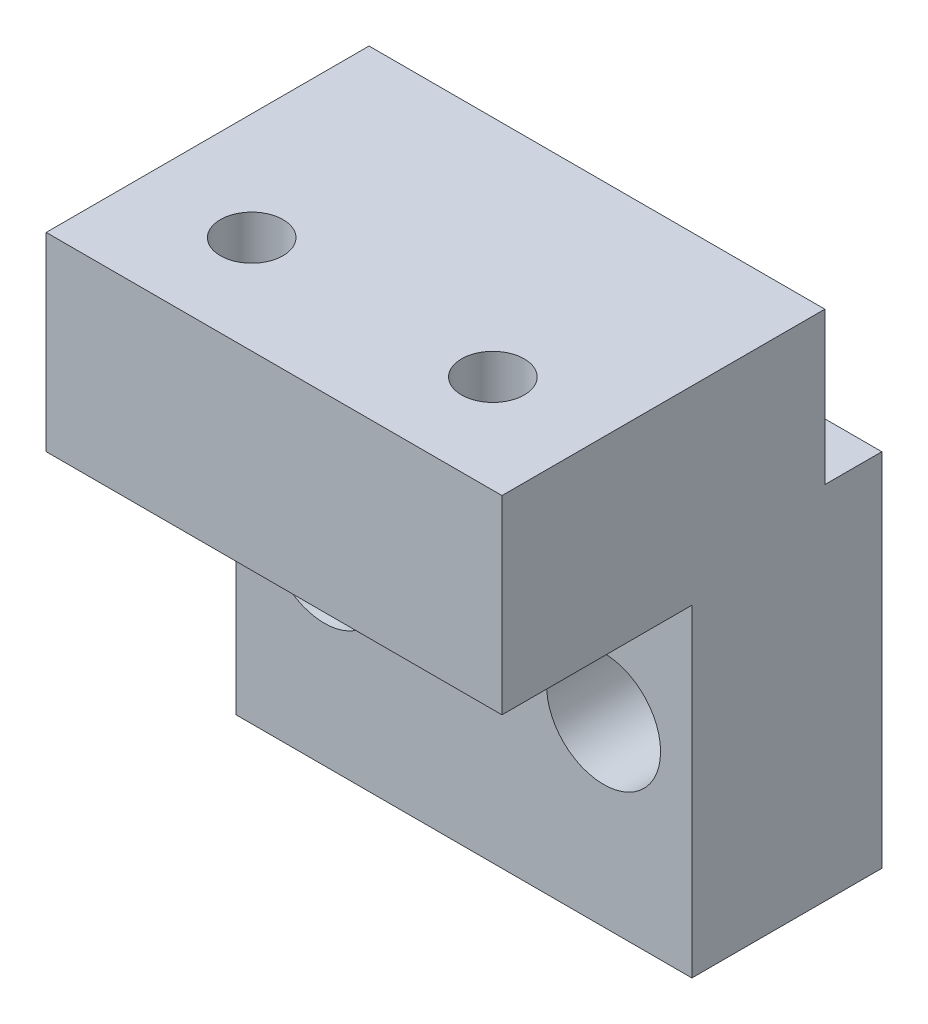
ISO-10303-21;
HEADER;
FILE_DESCRIPTION(('STEP AP214'),'2;1');
FILE_NAME('part.step','',(''),(''),'','','');
FILE_SCHEMA(('AUTOMOTIVE_DESIGN { 1 0 10303 214 1 1 1 1 }'));
ENDSEC;
DATA;
#1=APPLICATION_CONTEXT('core data for automotive mechanical design processes');
#2=APPLICATION_PROTOCOL_DEFINITION('international standard','automotive_design',2000,#1);
#3=PRODUCT_CONTEXT('',#1,'mechanical');
#4=PRODUCT('Part','Part','',(#3));
#5=PRODUCT_RELATED_PRODUCT_CATEGORY('part','',(#4));
#6=PRODUCT_DEFINITION_FORMATION('','',#4);
#7=PRODUCT_DEFINITION_CONTEXT('part definition',#1,'design');
#8=PRODUCT_DEFINITION('design','',#6,#7);
#9=PRODUCT_DEFINITION_SHAPE('','',#8);
#10=(LENGTH_UNIT() NAMED_UNIT(*) SI_UNIT(.MILLI.,.METRE.));
#11=(NAMED_UNIT(*) PLANE_ANGLE_UNIT() SI_UNIT($,.RADIAN.));
#12=(NAMED_UNIT(*) SI_UNIT($,.STERADIAN.) SOLID_ANGLE_UNIT());
#13=UNCERTAINTY_MEASURE_WITH_UNIT(LENGTH_MEASURE(1.E-05),#10,'distance_accuracy_value','');
#14=(GEOMETRIC_REPRESENTATION_CONTEXT(3) GLOBAL_UNCERTAINTY_ASSIGNED_CONTEXT((#13)) GLOBAL_UNIT_ASSIGNED_CONTEXT((#10,
#11,#12)) REPRESENTATION_CONTEXT('',''));
#15=CARTESIAN_POINT('',(0.,0.,0.));
#16=DIRECTION('',(0.,0.,1.));
#17=DIRECTION('',(1.,0.,0.));
#18=AXIS2_PLACEMENT_3D('',#15,#16,#17);
#19=CARTESIAN_POINT('',(-18.35,27.999975,14.8295040212929));
#20=DIRECTION('',(0.,1.,0.));
#21=DIRECTION('',(0.,0.,1.));
#22=AXIS2_PLACEMENT_3D('',#19,#20,#21);
#23=CYLINDRICAL_SURFACE('',#22,1.65);
#24=CARTESIAN_POINT('',(-18.35,55.,14.8295040212929));
#25=DIRECTION('',(0.,1.,0.));
#26=DIRECTION('',(0.,0.,1.));
#27=AXIS2_PLACEMENT_3D('',#24,#25,#26);
#28=CIRCLE('',#27,1.65);
#29=CARTESIAN_POINT('',(-18.35,55.,16.4795040212929));
#30=VERTEX_POINT('',#29);
#31=EDGE_CURVE('E273',#30,#30,#28,.T.);
#32=ORIENTED_EDGE('',*,*,#31,.T.);
#33=EDGE_LOOP('',(#32));
#34=FACE_BOUND('',#33,.T.);
#35=CARTESIAN_POINT('',(-18.35,47.2,14.8295040212929));
#36=DIRECTION('',(0.,-1.,0.));
#37=DIRECTION('',(0.,0.,-1.));
#38=AXIS2_PLACEMENT_3D('',#35,#36,#37);
#39=CIRCLE('',#38,1.65);
#40=CARTESIAN_POINT('',(-18.35,47.2,13.1795040212929));
#41=VERTEX_POINT('',#40);
#42=EDGE_CURVE('E36',#41,#41,#39,.F.);
#43=ORIENTED_EDGE('',*,*,#42,.F.);
#44=EDGE_LOOP('',(#43));
#45=FACE_BOUND('',#44,.T.);
#46=ADVANCED_FACE('F32',(#34,#45),#23,.F.);
#47=CARTESIAN_POINT('',(-5.65,27.999975,14.8295040212929));
#48=DIRECTION('',(0.,1.,0.));
#49=DIRECTION('',(0.,0.,1.));
#50=AXIS2_PLACEMENT_3D('',#47,#48,#49);
#51=CYLINDRICAL_SURFACE('',#50,1.65);
#52=CARTESIAN_POINT('',(-5.65,55.,14.8295040212929));
#53=DIRECTION('',(0.,1.,0.));
#54=DIRECTION('',(0.,0.,1.));
#55=AXIS2_PLACEMENT_3D('',#52,#53,#54);
#56=CIRCLE('',#55,1.65);
#57=CARTESIAN_POINT('',(-5.65,55.,16.4795040212929));
#58=VERTEX_POINT('',#57);
#59=EDGE_CURVE('E276',#58,#58,#56,.T.);
#60=ORIENTED_EDGE('',*,*,#59,.T.);
#61=EDGE_LOOP('',(#60));
#62=FACE_BOUND('',#61,.T.);
#63=CARTESIAN_POINT('',(-5.65,47.2,14.8295040212929));
#64=DIRECTION('',(0.,-1.,0.));
#65=DIRECTION('',(0.,0.,-1.));
#66=AXIS2_PLACEMENT_3D('',#63,#64,#65);
#67=CIRCLE('',#66,1.65);
#68=CARTESIAN_POINT('',(-5.65,47.2,13.1795040212929));
#69=VERTEX_POINT('',#68);
#70=EDGE_CURVE('E263',#69,#69,#67,.F.);
#71=ORIENTED_EDGE('',*,*,#70,.F.);
#72=EDGE_LOOP('',(#71));
#73=FACE_BOUND('',#72,.T.);
#74=ADVANCED_FACE('F316',(#62,#73),#51,.F.);
#75=CARTESIAN_POINT('',(-24.,47.,10.));
#76=DIRECTION('',(0.,-1.,0.));
#77=DIRECTION('',(0.,0.,-1.));
#78=AXIS2_PLACEMENT_3D('',#75,#76,#77);
#79=PLANE('',#78);
#80=DIRECTION('',(-1.,0.,0.));
#81=VECTOR('',#80,1.);
#82=CARTESIAN_POINT('',(0.,47.,3.));
#83=LINE('',#82,#81);
#84=CARTESIAN_POINT('',(0.,47.,3.));
#85=VERTEX_POINT('',#84);
#86=CARTESIAN_POINT('',(-24.,47.,3.));
#87=VERTEX_POINT('',#86);
#88=EDGE_CURVE('E309',#85,#87,#83,.T.);
#89=ORIENTED_EDGE('',*,*,#88,.F.);
#90=DIRECTION('',(0.,0.,-1.));
#91=VECTOR('',#90,1.);
#92=CARTESIAN_POINT('',(0.,47.,10.));
#93=LINE('',#92,#91);
#94=CARTESIAN_POINT('',(0.,47.,0.));
#95=VERTEX_POINT('',#94);
#96=EDGE_CURVE('E405',#85,#95,#93,.T.);
#97=ORIENTED_EDGE('',*,*,#96,.T.);
#98=DIRECTION('',(-1.,0.,0.));
#99=VECTOR('',#98,1.);
#100=CARTESIAN_POINT('',(-24.,47.,0.));
#101=LINE('',#100,#99);
#102=CARTESIAN_POINT('',(-24.,47.,0.));
#103=VERTEX_POINT('',#102);
#104=EDGE_CURVE('E409',#95,#103,#101,.T.);
#105=ORIENTED_EDGE('',*,*,#104,.T.);
#106=DIRECTION('',(0.,0.,-1.));
#107=VECTOR('',#106,1.);
#108=CARTESIAN_POINT('',(-24.,47.,10.));
#109=LINE('',#108,#107);
#110=EDGE_CURVE('E419',#87,#103,#109,.T.);
#111=ORIENTED_EDGE('',*,*,#110,.F.);
#112=EDGE_LOOP('',(#89,#97,#105,#111));
#113=FACE_BOUND('',#112,.T.);
#114=ADVANCED_FACE('F318',(#113),#79,.F.);
#115=CARTESIAN_POINT('',(-19.35,37.5,10.));
#116=DIRECTION('',(0.,0.,-1.));
#117=DIRECTION('',(-1.,0.,0.));
#118=AXIS2_PLACEMENT_3D('',#115,#116,#117);
#119=CYLINDRICAL_SURFACE('',#118,1.65);
#120=CARTESIAN_POINT('',(-19.35,37.5,0.));
#121=DIRECTION('',(0.,0.,1.));
#122=DIRECTION('',(1.,0.,0.));
#123=AXIS2_PLACEMENT_3D('',#120,#121,#122);
#124=CIRCLE('',#123,1.65);
#125=CARTESIAN_POINT('',(-17.7,37.5,0.));
#126=VERTEX_POINT('',#125);
#127=EDGE_CURVE('E451',#126,#126,#124,.T.);
#128=ORIENTED_EDGE('',*,*,#127,.F.);
#129=EDGE_LOOP('',(#128));
#130=FACE_BOUND('',#129,.T.);
#131=CARTESIAN_POINT('',(-19.35,37.5,4.5));
#132=DIRECTION('',(0.,0.,1.));
#133=DIRECTION('',(1.,0.,0.));
#134=AXIS2_PLACEMENT_3D('',#131,#132,#133);
#135=CIRCLE('',#134,1.65);
#136=CARTESIAN_POINT('',(-17.7,37.5,4.5));
#137=VERTEX_POINT('',#136);
#138=EDGE_CURVE('E422',#137,#137,#135,.T.);
#139=ORIENTED_EDGE('',*,*,#138,.T.);
#140=EDGE_LOOP('',(#139));
#141=FACE_BOUND('',#140,.T.);
#142=ADVANCED_FACE('F325',(#130,#141),#119,.F.);
#143=CARTESIAN_POINT('',(-4.65,37.5,10.));
#144=DIRECTION('',(0.,0.,-1.));
#145=DIRECTION('',(-1.,0.,0.));
#146=AXIS2_PLACEMENT_3D('',#143,#144,#145);
#147=CYLINDRICAL_SURFACE('',#146,1.65);
#148=CARTESIAN_POINT('',(-4.65,37.5,0.));
#149=DIRECTION('',(0.,0.,1.));
#150=DIRECTION('',(1.,0.,0.));
#151=AXIS2_PLACEMENT_3D('',#148,#149,#150);
#152=CIRCLE('',#151,1.65);
#153=CARTESIAN_POINT('',(-3.,37.5,0.));
#154=VERTEX_POINT('',#153);
#155=EDGE_CURVE('E448',#154,#154,#152,.T.);
#156=ORIENTED_EDGE('',*,*,#155,.F.);
#157=EDGE_LOOP('',(#156));
#158=FACE_BOUND('',#157,.T.);
#159=CARTESIAN_POINT('',(-4.65,37.5,4.5));
#160=DIRECTION('',(0.,0.,1.));
#161=DIRECTION('',(1.,0.,0.));
#162=AXIS2_PLACEMENT_3D('',#159,#160,#161);
#163=CIRCLE('',#162,1.65);
#164=CARTESIAN_POINT('',(-3.,37.5,4.5));
#165=VERTEX_POINT('',#164);
#166=EDGE_CURVE('E444',#165,#165,#163,.T.);
#167=ORIENTED_EDGE('',*,*,#166,.T.);
#168=EDGE_LOOP('',(#167));
#169=FACE_BOUND('',#168,.T.);
#170=ADVANCED_FACE('F365',(#158,#169),#147,.F.);
#171=CARTESIAN_POINT('',(0.,0.,10.));
#172=DIRECTION('',(0.,0.,1.));
#173=DIRECTION('',(1.,0.,0.));
#174=AXIS2_PLACEMENT_3D('',#171,#172,#173);
#175=PLANE('',#174);
#176=DIRECTION('',(1.,0.,0.));
#177=VECTOR('',#176,1.);
#178=CARTESIAN_POINT('',(0.,45.,10.));
#179=LINE('',#178,#177);
#180=CARTESIAN_POINT('',(-24.,45.,10.));
#181=VERTEX_POINT('',#180);
#182=CARTESIAN_POINT('',(0.,45.,10.));
#183=VERTEX_POINT('',#182);
#184=EDGE_CURVE('E279',#181,#183,#179,.T.);
#185=ORIENTED_EDGE('',*,*,#184,.F.);
#186=DIRECTION('',(0.,-1.,0.));
#187=VECTOR('',#186,1.);
#188=CARTESIAN_POINT('',(-24.,47.,10.));
#189=LINE('',#188,#187);
#190=CARTESIAN_POINT('',(-24.,28.,10.));
#191=VERTEX_POINT('',#190);
#192=EDGE_CURVE('E411',#181,#191,#189,.T.);
#193=ORIENTED_EDGE('',*,*,#192,.T.);
#194=DIRECTION('',(1.,0.,0.));
#195=VECTOR('',#194,1.);
#196=CARTESIAN_POINT('',(-24.,28.,10.));
#197=LINE('',#196,#195);
#198=CARTESIAN_POINT('',(0.,28.,10.));
#199=VERTEX_POINT('',#198);
#200=EDGE_CURVE('E456',#191,#199,#197,.T.);
#201=ORIENTED_EDGE('',*,*,#200,.T.);
#202=DIRECTION('',(0.,1.,0.));
#203=VECTOR('',#202,1.);
#204=CARTESIAN_POINT('',(0.,47.,10.));
#205=LINE('',#204,#203);
#206=EDGE_CURVE('E299',#199,#183,#205,.T.);
#207=ORIENTED_EDGE('',*,*,#206,.T.);
#208=EDGE_LOOP('',(#185,#193,#201,#207));
#209=FACE_BOUND('',#208,.T.);
#210=CARTESIAN_POINT('',(-19.35,37.5,10.));
#211=DIRECTION('',(0.,0.,1.));
#212=DIRECTION('',(1.,0.,0.));
#213=AXIS2_PLACEMENT_3D('',#210,#211,#212);
#214=CIRCLE('',#213,3.);
#215=CARTESIAN_POINT('',(-16.35,37.5,10.));
#216=VERTEX_POINT('',#215);
#217=EDGE_CURVE('E437',#216,#216,#214,.T.);
#218=ORIENTED_EDGE('',*,*,#217,.F.);
#219=EDGE_LOOP('',(#218));
#220=FACE_BOUND('',#219,.T.);
#221=CARTESIAN_POINT('',(-4.65,37.5,10.));
#222=DIRECTION('',(0.,0.,1.));
#223=DIRECTION('',(1.,0.,0.));
#224=AXIS2_PLACEMENT_3D('',#221,#222,#223);
#225=CIRCLE('',#224,3.);
#226=CARTESIAN_POINT('',(-1.65,37.5,10.));
#227=VERTEX_POINT('',#226);
#228=EDGE_CURVE('E445',#227,#227,#225,.T.);
#229=ORIENTED_EDGE('',*,*,#228,.F.);
#230=EDGE_LOOP('',(#229));
#231=FACE_BOUND('',#230,.T.);
#232=ADVANCED_FACE('F368',(#209,#220,#231),#175,.T.);
#233=CARTESIAN_POINT('',(0.,0.,0.));
#234=DIRECTION('',(0.,0.,1.));
#235=DIRECTION('',(1.,0.,0.));
#236=AXIS2_PLACEMENT_3D('',#233,#234,#235);
#237=PLANE('',#236);
#238=ORIENTED_EDGE('',*,*,#127,.T.);
#239=EDGE_LOOP('',(#238));
#240=FACE_BOUND('',#239,.T.);
#241=DIRECTION('',(0.,-1.,0.));
#242=VECTOR('',#241,1.);
#243=CARTESIAN_POINT('',(-24.,47.,0.));
#244=LINE('',#243,#242);
#245=CARTESIAN_POINT('',(-24.,28.,0.));
#246=VERTEX_POINT('',#245);
#247=EDGE_CURVE('E400',#103,#246,#244,.T.);
#248=ORIENTED_EDGE('',*,*,#247,.F.);
#249=ORIENTED_EDGE('',*,*,#104,.F.);
#250=DIRECTION('',(0.,1.,0.));
#251=VECTOR('',#250,1.);
#252=CARTESIAN_POINT('',(0.,47.,0.));
#253=LINE('',#252,#251);
#254=CARTESIAN_POINT('',(0.,28.,0.));
#255=VERTEX_POINT('',#254);
#256=EDGE_CURVE('E399',#255,#95,#253,.T.);
#257=ORIENTED_EDGE('',*,*,#256,.F.);
#258=DIRECTION('',(1.,0.,0.));
#259=VECTOR('',#258,1.);
#260=CARTESIAN_POINT('',(-24.,28.,0.));
#261=LINE('',#260,#259);
#262=EDGE_CURVE('E390',#246,#255,#261,.T.);
#263=ORIENTED_EDGE('',*,*,#262,.F.);
#264=EDGE_LOOP('',(#248,#249,#257,#263));
#265=FACE_BOUND('',#264,.T.);
#266=ORIENTED_EDGE('',*,*,#155,.T.);
#267=EDGE_LOOP('',(#266));
#268=FACE_BOUND('',#267,.T.);
#269=ADVANCED_FACE('F375',(#240,#265,#268),#237,.F.);
#270=CARTESIAN_POINT('',(-24.,47.,10.));
#271=DIRECTION('',(1.,0.,0.));
#272=DIRECTION('',(0.,0.,-1.));
#273=AXIS2_PLACEMENT_3D('',#270,#271,#272);
#274=PLANE('',#273);
#275=ORIENTED_EDGE('',*,*,#247,.T.);
#276=DIRECTION('',(0.,0.,-1.));
#277=VECTOR('',#276,1.);
#278=CARTESIAN_POINT('',(-24.,28.,10.));
#279=LINE('',#278,#277);
#280=EDGE_CURVE('E11',#191,#246,#279,.T.);
#281=ORIENTED_EDGE('',*,*,#280,.F.);
#282=ORIENTED_EDGE('',*,*,#192,.F.);
#283=DIRECTION('',(0.,0.,-1.));
#284=VECTOR('',#283,1.);
#285=CARTESIAN_POINT('',(-24.,45.,20.));
#286=LINE('',#285,#284);
#287=CARTESIAN_POINT('',(-24.,45.,20.));
#288=VERTEX_POINT('',#287);
#289=EDGE_CURVE('E304',#288,#181,#286,.T.);
#290=ORIENTED_EDGE('',*,*,#289,.F.);
#291=DIRECTION('',(0.,-1.,0.));
#292=VECTOR('',#291,1.);
#293=CARTESIAN_POINT('',(-24.,45.,20.));
#294=LINE('',#293,#292);
#295=CARTESIAN_POINT('',(-24.,55.,20.));
#296=VERTEX_POINT('',#295);
#297=EDGE_CURVE('E286',#296,#288,#294,.T.);
#298=ORIENTED_EDGE('',*,*,#297,.F.);
#299=DIRECTION('',(0.,0.,1.));
#300=VECTOR('',#299,1.);
#301=CARTESIAN_POINT('',(-24.,55.,10.));
#302=LINE('',#301,#300);
#303=CARTESIAN_POINT('',(-24.,55.,3.));
#304=VERTEX_POINT('',#303);
#305=EDGE_CURVE('E433',#304,#296,#302,.T.);
#306=ORIENTED_EDGE('',*,*,#305,.F.);
#307=DIRECTION('',(0.,-1.,0.));
#308=VECTOR('',#307,1.);
#309=CARTESIAN_POINT('',(-24.,55.,3.));
#310=LINE('',#309,#308);
#311=EDGE_CURVE('E428',#304,#87,#310,.T.);
#312=ORIENTED_EDGE('',*,*,#311,.T.);
#313=ORIENTED_EDGE('',*,*,#110,.T.);
#314=EDGE_LOOP('',(#275,#281,#282,#290,#298,#306,#312,#313));
#315=FACE_BOUND('',#314,.T.);
#316=ADVANCED_FACE('F34',(#315),#274,.F.);
#317=CARTESIAN_POINT('',(-24.,28.,10.));
#318=DIRECTION('',(0.,1.,0.));
#319=DIRECTION('',(0.,0.,1.));
#320=AXIS2_PLACEMENT_3D('',#317,#318,#319);
#321=PLANE('',#320);
#322=ORIENTED_EDGE('',*,*,#262,.T.);
#323=DIRECTION('',(0.,0.,-1.));
#324=VECTOR('',#323,1.);
#325=CARTESIAN_POINT('',(0.,28.,10.));
#326=LINE('',#325,#324);
#327=EDGE_CURVE('E41',#199,#255,#326,.T.);
#328=ORIENTED_EDGE('',*,*,#327,.F.);
#329=ORIENTED_EDGE('',*,*,#200,.F.);
#330=ORIENTED_EDGE('',*,*,#280,.T.);
#331=EDGE_LOOP('',(#322,#328,#329,#330));
#332=FACE_BOUND('',#331,.T.);
#333=ADVANCED_FACE('F381',(#332),#321,.F.);
#334=CARTESIAN_POINT('',(0.,47.,10.));
#335=DIRECTION('',(-1.,0.,0.));
#336=DIRECTION('',(0.,0.,1.));
#337=AXIS2_PLACEMENT_3D('',#334,#335,#336);
#338=PLANE('',#337);
#339=ORIENTED_EDGE('',*,*,#256,.T.);
#340=ORIENTED_EDGE('',*,*,#96,.F.);
#341=DIRECTION('',(0.,-1.,0.));
#342=VECTOR('',#341,1.);
#343=CARTESIAN_POINT('',(0.,55.,3.));
#344=LINE('',#343,#342);
#345=CARTESIAN_POINT('',(0.,55.,3.));
#346=VERTEX_POINT('',#345);
#347=EDGE_CURVE('E440',#346,#85,#344,.T.);
#348=ORIENTED_EDGE('',*,*,#347,.F.);
#349=DIRECTION('',(0.,0.,-1.));
#350=VECTOR('',#349,1.);
#351=CARTESIAN_POINT('',(0.,55.,10.));
#352=LINE('',#351,#350);
#353=CARTESIAN_POINT('',(0.,55.,20.));
#354=VERTEX_POINT('',#353);
#355=EDGE_CURVE('E293',#354,#346,#352,.T.);
#356=ORIENTED_EDGE('',*,*,#355,.F.);
#357=DIRECTION('',(0.,1.,0.));
#358=VECTOR('',#357,1.);
#359=CARTESIAN_POINT('',(0.,45.,20.));
#360=LINE('',#359,#358);
#361=CARTESIAN_POINT('',(0.,45.,20.));
#362=VERTEX_POINT('',#361);
#363=EDGE_CURVE('E280',#362,#354,#360,.T.);
#364=ORIENTED_EDGE('',*,*,#363,.F.);
#365=DIRECTION('',(0.,0.,-1.));
#366=VECTOR('',#365,1.);
#367=CARTESIAN_POINT('',(0.,45.,20.));
#368=LINE('',#367,#366);
#369=EDGE_CURVE('E290',#362,#183,#368,.T.);
#370=ORIENTED_EDGE('',*,*,#369,.T.);
#371=ORIENTED_EDGE('',*,*,#206,.F.);
#372=ORIENTED_EDGE('',*,*,#327,.T.);
#373=EDGE_LOOP('',(#339,#340,#348,#356,#364,#370,#371,#372));
#374=FACE_BOUND('',#373,.T.);
#375=ADVANCED_FACE('F363',(#374),#338,.F.);
#376=CARTESIAN_POINT('',(-4.65,37.5,4.5));
#377=DIRECTION('',(0.,0.,1.));
#378=DIRECTION('',(1.,0.,0.));
#379=AXIS2_PLACEMENT_3D('',#376,#377,#378);
#380=CYLINDRICAL_SURFACE('',#379,3.);
#381=CARTESIAN_POINT('',(-4.65,37.5,4.5));
#382=DIRECTION('',(0.,0.,1.));
#383=DIRECTION('',(1.,0.,0.));
#384=AXIS2_PLACEMENT_3D('',#381,#382,#383);
#385=CIRCLE('',#384,3.);
#386=CARTESIAN_POINT('',(-1.65,37.5,4.5));
#387=VERTEX_POINT('',#386);
#388=EDGE_CURVE('E441',#387,#387,#385,.T.);
#389=ORIENTED_EDGE('',*,*,#388,.F.);
#390=EDGE_LOOP('',(#389));
#391=FACE_BOUND('',#390,.T.);
#392=ORIENTED_EDGE('',*,*,#228,.T.);
#393=EDGE_LOOP('',(#392));
#394=FACE_BOUND('',#393,.T.);
#395=ADVANCED_FACE('F359',(#391,#394),#380,.F.);
#396=CARTESIAN_POINT('',(-4.65,37.5,4.5));
#397=DIRECTION('',(0.,0.,1.));
#398=DIRECTION('',(1.,0.,0.));
#399=AXIS2_PLACEMENT_3D('',#396,#397,#398);
#400=PLANE('',#399);
#401=ORIENTED_EDGE('',*,*,#166,.F.);
#402=EDGE_LOOP('',(#401));
#403=FACE_BOUND('',#402,.T.);
#404=ORIENTED_EDGE('',*,*,#388,.T.);
#405=EDGE_LOOP('',(#404));
#406=FACE_BOUND('',#405,.T.);
#407=ADVANCED_FACE('F355',(#403,#406),#400,.T.);
#408=CARTESIAN_POINT('',(-19.35,37.5,4.5));
#409=DIRECTION('',(0.,0.,1.));
#410=DIRECTION('',(1.,0.,0.));
#411=AXIS2_PLACEMENT_3D('',#408,#409,#410);
#412=CYLINDRICAL_SURFACE('',#411,3.);
#413=CARTESIAN_POINT('',(-19.35,37.5,4.5));
#414=DIRECTION('',(0.,0.,1.));
#415=DIRECTION('',(1.,0.,0.));
#416=AXIS2_PLACEMENT_3D('',#413,#414,#415);
#417=CIRCLE('',#416,3.);
#418=CARTESIAN_POINT('',(-16.35,37.5,4.5));
#419=VERTEX_POINT('',#418);
#420=EDGE_CURVE('E434',#419,#419,#417,.T.);
#421=ORIENTED_EDGE('',*,*,#420,.F.);
#422=EDGE_LOOP('',(#421));
#423=FACE_BOUND('',#422,.T.);
#424=ORIENTED_EDGE('',*,*,#217,.T.);
#425=EDGE_LOOP('',(#424));
#426=FACE_BOUND('',#425,.T.);
#427=ADVANCED_FACE('F351',(#423,#426),#412,.F.);
#428=CARTESIAN_POINT('',(-19.35,37.5,4.5));
#429=DIRECTION('',(0.,0.,1.));
#430=DIRECTION('',(1.,0.,0.));
#431=AXIS2_PLACEMENT_3D('',#428,#429,#430);
#432=PLANE('',#431);
#433=ORIENTED_EDGE('',*,*,#138,.F.);
#434=EDGE_LOOP('',(#433));
#435=FACE_BOUND('',#434,.T.);
#436=ORIENTED_EDGE('',*,*,#420,.T.);
#437=EDGE_LOOP('',(#436));
#438=FACE_BOUND('',#437,.T.);
#439=ADVANCED_FACE('F347',(#435,#438),#432,.T.);
#440=CARTESIAN_POINT('',(0.,55.,3.));
#441=DIRECTION('',(0.,0.,1.));
#442=DIRECTION('',(1.,0.,0.));
#443=AXIS2_PLACEMENT_3D('',#440,#441,#442);
#444=PLANE('',#443);
#445=ORIENTED_EDGE('',*,*,#88,.T.);
#446=ORIENTED_EDGE('',*,*,#311,.F.);
#447=DIRECTION('',(-1.,0.,0.));
#448=VECTOR('',#447,1.);
#449=CARTESIAN_POINT('',(0.,55.,3.));
#450=LINE('',#449,#448);
#451=EDGE_CURVE('E466',#346,#304,#450,.T.);
#452=ORIENTED_EDGE('',*,*,#451,.F.);
#453=ORIENTED_EDGE('',*,*,#347,.T.);
#454=EDGE_LOOP('',(#445,#446,#452,#453));
#455=FACE_BOUND('',#454,.T.);
#456=ADVANCED_FACE('F343',(#455),#444,.F.);
#457=CARTESIAN_POINT('',(0.,55.,0.));
#458=DIRECTION('',(0.,1.,0.));
#459=DIRECTION('',(0.,0.,1.));
#460=AXIS2_PLACEMENT_3D('',#457,#458,#459);
#461=PLANE('',#460);
#462=ORIENTED_EDGE('',*,*,#31,.F.);
#463=EDGE_LOOP('',(#462));
#464=FACE_BOUND('',#463,.T.);
#465=ORIENTED_EDGE('',*,*,#59,.F.);
#466=EDGE_LOOP('',(#465));
#467=FACE_BOUND('',#466,.T.);
#468=ORIENTED_EDGE('',*,*,#355,.T.);
#469=ORIENTED_EDGE('',*,*,#451,.T.);
#470=ORIENTED_EDGE('',*,*,#305,.T.);
#471=DIRECTION('',(-1.,0.,0.));
#472=VECTOR('',#471,1.);
#473=CARTESIAN_POINT('',(0.,55.,20.));
#474=LINE('',#473,#472);
#475=EDGE_CURVE('E283',#354,#296,#474,.T.);
#476=ORIENTED_EDGE('',*,*,#475,.F.);
#477=EDGE_LOOP('',(#468,#469,#470,#476));
#478=FACE_BOUND('',#477,.T.);
#479=ADVANCED_FACE('F339',(#464,#467,#478),#461,.T.);
#480=CARTESIAN_POINT('',(0.,45.,20.));
#481=DIRECTION('',(0.,1.,0.));
#482=DIRECTION('',(0.,0.,1.));
#483=AXIS2_PLACEMENT_3D('',#480,#481,#482);
#484=PLANE('',#483);
#485=DIRECTION('',(-0.500000000000001,0.,0.866025403784438));
#486=VECTOR('',#485,1.);
#487=CARTESIAN_POINT('',(-15.0591034656192,45.,14.8295040212929));
#488=LINE('',#487,#486);
#489=CARTESIAN_POINT('',(-15.0591034656192,45.,14.8295040212929));
#490=VERTEX_POINT('',#489);
#491=CARTESIAN_POINT('',(-16.7045517328096,45.,17.6795040212929));
#492=VERTEX_POINT('',#491);
#493=EDGE_CURVE('E207',#490,#492,#488,.T.);
#494=ORIENTED_EDGE('',*,*,#493,.F.);
#495=DIRECTION('',(0.5,0.,0.866025403784439));
#496=VECTOR('',#495,1.);
#497=CARTESIAN_POINT('',(-16.7045517328096,45.,11.9795040212929));
#498=LINE('',#497,#496);
#499=CARTESIAN_POINT('',(-16.7045517328096,45.,11.9795040212929));
#500=VERTEX_POINT('',#499);
#501=EDGE_CURVE('E49',#500,#490,#498,.T.);
#502=ORIENTED_EDGE('',*,*,#501,.F.);
#503=DIRECTION('',(1.,0.,0.));
#504=VECTOR('',#503,1.);
#505=CARTESIAN_POINT('',(-19.9954482671905,45.,11.9795040212929));
#506=LINE('',#505,#504);
#507=CARTESIAN_POINT('',(-19.9954482671905,45.,11.9795040212929));
#508=VERTEX_POINT('',#507);
#509=EDGE_CURVE('E193',#508,#500,#506,.T.);
#510=ORIENTED_EDGE('',*,*,#509,.F.);
#511=DIRECTION('',(0.5,0.,-0.866025403784438));
#512=VECTOR('',#511,1.);
#513=CARTESIAN_POINT('',(-21.6408965343809,45.,14.8295040212929));
#514=LINE('',#513,#512);
#515=CARTESIAN_POINT('',(-21.6408965343809,45.,14.8295040212929));
#516=VERTEX_POINT('',#515);
#517=EDGE_CURVE('E196',#516,#508,#514,.T.);
#518=ORIENTED_EDGE('',*,*,#517,.F.);
#519=DIRECTION('',(-0.5,0.,-0.866025403784438));
#520=VECTOR('',#519,1.);
#521=CARTESIAN_POINT('',(-19.9954482671905,45.,17.6795040212929));
#522=LINE('',#521,#520);
#523=CARTESIAN_POINT('',(-19.9954482671905,45.,17.6795040212929));
#524=VERTEX_POINT('',#523);
#525=EDGE_CURVE('E212',#524,#516,#522,.T.);
#526=ORIENTED_EDGE('',*,*,#525,.F.);
#527=DIRECTION('',(-1.,0.,0.));
#528=VECTOR('',#527,1.);
#529=CARTESIAN_POINT('',(-16.7045517328096,45.,17.6795040212929));
#530=LINE('',#529,#528);
#531=EDGE_CURVE('E209',#492,#524,#530,.T.);
#532=ORIENTED_EDGE('',*,*,#531,.F.);
#533=EDGE_LOOP('',(#494,#502,#510,#518,#526,#532));
#534=FACE_BOUND('',#533,.T.);
#535=DIRECTION('',(-0.5,0.,0.866025403784438));
#536=VECTOR('',#535,1.);
#537=CARTESIAN_POINT('',(-2.35910346561914,45.,14.8295040212929));
#538=LINE('',#537,#536);
#539=CARTESIAN_POINT('',(-2.35910346561914,45.,14.8295040212929));
#540=VERTEX_POINT('',#539);
#541=CARTESIAN_POINT('',(-4.00455173280957,45.,17.6795040212929));
#542=VERTEX_POINT('',#541);
#543=EDGE_CURVE('E247',#540,#542,#538,.T.);
#544=ORIENTED_EDGE('',*,*,#543,.F.);
#545=DIRECTION('',(0.499999999999999,0.,0.866025403784439));
#546=VECTOR('',#545,1.);
#547=CARTESIAN_POINT('',(-4.00455173280957,45.,11.9795040212929));
#548=LINE('',#547,#546);
#549=CARTESIAN_POINT('',(-4.00455173280957,45.,11.9795040212929));
#550=VERTEX_POINT('',#549);
#551=EDGE_CURVE('E57',#550,#540,#548,.T.);
#552=ORIENTED_EDGE('',*,*,#551,.F.);
#553=DIRECTION('',(1.,0.,0.));
#554=VECTOR('',#553,1.);
#555=CARTESIAN_POINT('',(-7.29544826719043,45.,11.9795040212929));
#556=LINE('',#555,#554);
#557=CARTESIAN_POINT('',(-7.29544826719043,45.,11.9795040212929));
#558=VERTEX_POINT('',#557);
#559=EDGE_CURVE('E230',#558,#550,#556,.T.);
#560=ORIENTED_EDGE('',*,*,#559,.F.);
#561=DIRECTION('',(0.5,0.,-0.866025403784438));
#562=VECTOR('',#561,1.);
#563=CARTESIAN_POINT('',(-8.94089653438086,45.,14.8295040212929));
#564=LINE('',#563,#562);
#565=CARTESIAN_POINT('',(-8.94089653438086,45.,14.8295040212929));
#566=VERTEX_POINT('',#565);
#567=EDGE_CURVE('E256',#566,#558,#564,.T.);
#568=ORIENTED_EDGE('',*,*,#567,.F.);
#569=DIRECTION('',(-0.5,0.,-0.866025403784439));
#570=VECTOR('',#569,1.);
#571=CARTESIAN_POINT('',(-7.29544826719043,45.,17.6795040212929));
#572=LINE('',#571,#570);
#573=CARTESIAN_POINT('',(-7.29544826719043,45.,17.6795040212929));
#574=VERTEX_POINT('',#573);
#575=EDGE_CURVE('E253',#574,#566,#572,.T.);
#576=ORIENTED_EDGE('',*,*,#575,.F.);
#577=DIRECTION('',(-1.,0.,0.));
#578=VECTOR('',#577,1.);
#579=CARTESIAN_POINT('',(-4.00455173280957,45.,17.6795040212929));
#580=LINE('',#579,#578);
#581=EDGE_CURVE('E250',#542,#574,#580,.T.);
#582=ORIENTED_EDGE('',*,*,#581,.F.);
#583=EDGE_LOOP('',(#544,#552,#560,#568,#576,#582));
#584=FACE_BOUND('',#583,.T.);
#585=ORIENTED_EDGE('',*,*,#184,.T.);
#586=ORIENTED_EDGE('',*,*,#369,.F.);
#587=DIRECTION('',(1.,0.,0.));
#588=VECTOR('',#587,1.);
#589=CARTESIAN_POINT('',(0.,45.,20.));
#590=LINE('',#589,#588);
#591=EDGE_CURVE('E288',#288,#362,#590,.T.);
#592=ORIENTED_EDGE('',*,*,#591,.F.);
#593=ORIENTED_EDGE('',*,*,#289,.T.);
#594=EDGE_LOOP('',(#585,#586,#592,#593));
#595=FACE_BOUND('',#594,.T.);
#596=ADVANCED_FACE('F335',(#534,#584,#595),#484,.F.);
#597=CARTESIAN_POINT('',(0.,0.,20.));
#598=DIRECTION('',(0.,0.,1.));
#599=DIRECTION('',(1.,0.,0.));
#600=AXIS2_PLACEMENT_3D('',#597,#598,#599);
#601=PLANE('',#600);
#602=ORIENTED_EDGE('',*,*,#363,.T.);
#603=ORIENTED_EDGE('',*,*,#475,.T.);
#604=ORIENTED_EDGE('',*,*,#297,.T.);
#605=ORIENTED_EDGE('',*,*,#591,.T.);
#606=EDGE_LOOP('',(#602,#603,#604,#605));
#607=FACE_BOUND('',#606,.T.);
#608=ADVANCED_FACE('F332',(#607),#601,.T.);
#609=CARTESIAN_POINT('',(0.,47.2,0.));
#610=DIRECTION('',(0.,-1.,0.));
#611=DIRECTION('',(0.,0.,-1.));
#612=AXIS2_PLACEMENT_3D('',#609,#610,#611);
#613=PLANE('',#612);
#614=DIRECTION('',(0.499999999999999,0.,0.866025403784439));
#615=VECTOR('',#614,1.);
#616=CARTESIAN_POINT('',(-4.00455173280957,47.2,11.9795040212929));
#617=LINE('',#616,#615);
#618=CARTESIAN_POINT('',(-4.00455173280957,47.2,11.9795040212929));
#619=VERTEX_POINT('',#618);
#620=CARTESIAN_POINT('',(-2.35910346561914,47.2,14.8295040212929));
#621=VERTEX_POINT('',#620);
#622=EDGE_CURVE('E226',#619,#621,#617,.T.);
#623=ORIENTED_EDGE('',*,*,#622,.T.);
#624=DIRECTION('',(-0.5,0.,0.866025403784438));
#625=VECTOR('',#624,1.);
#626=CARTESIAN_POINT('',(-2.35910346561914,47.2,14.8295040212929));
#627=LINE('',#626,#625);
#628=CARTESIAN_POINT('',(-4.00455173280957,47.2,17.6795040212929));
#629=VERTEX_POINT('',#628);
#630=EDGE_CURVE('E229',#621,#629,#627,.T.);
#631=ORIENTED_EDGE('',*,*,#630,.T.);
#632=DIRECTION('',(-1.,0.,0.));
#633=VECTOR('',#632,1.);
#634=CARTESIAN_POINT('',(-4.00455173280957,47.2,17.6795040212929));
#635=LINE('',#634,#633);
#636=CARTESIAN_POINT('',(-7.29544826719043,47.2,17.6795040212929));
#637=VERTEX_POINT('',#636);
#638=EDGE_CURVE('E233',#629,#637,#635,.T.);
#639=ORIENTED_EDGE('',*,*,#638,.T.);
#640=DIRECTION('',(-0.5,0.,-0.866025403784439));
#641=VECTOR('',#640,1.);
#642=CARTESIAN_POINT('',(-7.29544826719043,47.2,17.6795040212929));
#643=LINE('',#642,#641);
#644=CARTESIAN_POINT('',(-8.94089653438086,47.2,14.8295040212929));
#645=VERTEX_POINT('',#644);
#646=EDGE_CURVE('E236',#637,#645,#643,.T.);
#647=ORIENTED_EDGE('',*,*,#646,.T.);
#648=DIRECTION('',(0.5,0.,-0.866025403784438));
#649=VECTOR('',#648,1.);
#650=CARTESIAN_POINT('',(-8.94089653438086,47.2,14.8295040212929));
#651=LINE('',#650,#649);
#652=CARTESIAN_POINT('',(-7.29544826719043,47.2,11.9795040212929));
#653=VERTEX_POINT('',#652);
#654=EDGE_CURVE('E239',#645,#653,#651,.T.);
#655=ORIENTED_EDGE('',*,*,#654,.T.);
#656=DIRECTION('',(1.,0.,0.));
#657=VECTOR('',#656,1.);
#658=CARTESIAN_POINT('',(-7.29544826719043,47.2,11.9795040212929));
#659=LINE('',#658,#657);
#660=EDGE_CURVE('E242',#653,#619,#659,.T.);
#661=ORIENTED_EDGE('',*,*,#660,.T.);
#662=EDGE_LOOP('',(#623,#631,#639,#647,#655,#661));
#663=FACE_BOUND('',#662,.T.);
#664=ORIENTED_EDGE('',*,*,#70,.T.);
#665=EDGE_LOOP('',(#664));
#666=FACE_BOUND('',#665,.T.);
#667=ADVANCED_FACE('F314',(#663,#666),#613,.T.);
#668=CARTESIAN_POINT('',(-4.00455173280957,47.2,11.9795040212929));
#669=DIRECTION('',(0.866025403784439,0.,-0.499999999999999));
#670=DIRECTION('',(-0.499999999999999,0.,-0.866025403784439));
#671=AXIS2_PLACEMENT_3D('',#668,#669,#670);
#672=PLANE('',#671);
#673=ORIENTED_EDGE('',*,*,#551,.T.);
#674=DIRECTION('',(0.,-1.,0.));
#675=VECTOR('',#674,1.);
#676=CARTESIAN_POINT('',(-2.35910346561914,47.2,14.8295040212929));
#677=LINE('',#676,#675);
#678=EDGE_CURVE('E245',#621,#540,#677,.T.);
#679=ORIENTED_EDGE('',*,*,#678,.F.);
#680=ORIENTED_EDGE('',*,*,#622,.F.);
#681=DIRECTION('',(0.,-1.,0.));
#682=VECTOR('',#681,1.);
#683=CARTESIAN_POINT('',(-4.00455173280957,47.2,11.9795040212929));
#684=LINE('',#683,#682);
#685=EDGE_CURVE('E261',#619,#550,#684,.T.);
#686=ORIENTED_EDGE('',*,*,#685,.T.);
#687=EDGE_LOOP('',(#673,#679,#680,#686));
#688=FACE_BOUND('',#687,.T.);
#689=ADVANCED_FACE('F554',(#688),#672,.F.);
#690=CARTESIAN_POINT('',(-7.29544826719043,47.2,11.9795040212929));
#691=DIRECTION('',(0.,0.,-1.));
#692=DIRECTION('',(-1.,0.,0.));
#693=AXIS2_PLACEMENT_3D('',#690,#691,#692);
#694=PLANE('',#693);
#695=ORIENTED_EDGE('',*,*,#559,.T.);
#696=ORIENTED_EDGE('',*,*,#685,.F.);
#697=ORIENTED_EDGE('',*,*,#660,.F.);
#698=DIRECTION('',(0.,-1.,0.));
#699=VECTOR('',#698,1.);
#700=CARTESIAN_POINT('',(-7.29544826719043,47.2,11.9795040212929));
#701=LINE('',#700,#699);
#702=EDGE_CURVE('E264',#653,#558,#701,.T.);
#703=ORIENTED_EDGE('',*,*,#702,.T.);
#704=EDGE_LOOP('',(#695,#696,#697,#703));
#705=FACE_BOUND('',#704,.T.);
#706=ADVANCED_FACE('F562',(#705),#694,.F.);
#707=CARTESIAN_POINT('',(-8.94089653438086,47.2,14.8295040212929));
#708=DIRECTION('',(-0.866025403784438,0.,-0.5));
#709=DIRECTION('',(-0.5,0.,0.866025403784438));
#710=AXIS2_PLACEMENT_3D('',#707,#708,#709);
#711=PLANE('',#710);
#712=ORIENTED_EDGE('',*,*,#567,.T.);
#713=ORIENTED_EDGE('',*,*,#702,.F.);
#714=ORIENTED_EDGE('',*,*,#654,.F.);
#715=DIRECTION('',(0.,-1.,0.));
#716=VECTOR('',#715,1.);
#717=CARTESIAN_POINT('',(-8.94089653438086,47.2,14.8295040212929));
#718=LINE('',#717,#716);
#719=EDGE_CURVE('E266',#645,#566,#718,.T.);
#720=ORIENTED_EDGE('',*,*,#719,.T.);
#721=EDGE_LOOP('',(#712,#713,#714,#720));
#722=FACE_BOUND('',#721,.T.);
#723=ADVANCED_FACE('F568',(#722),#711,.F.);
#724=CARTESIAN_POINT('',(-7.29544826719043,47.2,17.6795040212929));
#725=DIRECTION('',(-0.866025403784439,0.,0.5));
#726=DIRECTION('',(0.5,0.,0.866025403784439));
#727=AXIS2_PLACEMENT_3D('',#724,#725,#726);
#728=PLANE('',#727);
#729=ORIENTED_EDGE('',*,*,#575,.T.);
#730=ORIENTED_EDGE('',*,*,#719,.F.);
#731=ORIENTED_EDGE('',*,*,#646,.F.);
#732=DIRECTION('',(0.,-1.,0.));
#733=VECTOR('',#732,1.);
#734=CARTESIAN_POINT('',(-7.29544826719043,47.2,17.6795040212929));
#735=LINE('',#734,#733);
#736=EDGE_CURVE('E268',#637,#574,#735,.T.);
#737=ORIENTED_EDGE('',*,*,#736,.T.);
#738=EDGE_LOOP('',(#729,#730,#731,#737));
#739=FACE_BOUND('',#738,.T.);
#740=ADVANCED_FACE('F576',(#739),#728,.F.);
#741=CARTESIAN_POINT('',(-4.00455173280957,47.2,17.6795040212929));
#742=DIRECTION('',(0.,0.,1.));
#743=DIRECTION('',(1.,0.,0.));
#744=AXIS2_PLACEMENT_3D('',#741,#742,#743);
#745=PLANE('',#744);
#746=ORIENTED_EDGE('',*,*,#581,.T.);
#747=ORIENTED_EDGE('',*,*,#736,.F.);
#748=ORIENTED_EDGE('',*,*,#638,.F.);
#749=DIRECTION('',(0.,-1.,0.));
#750=VECTOR('',#749,1.);
#751=CARTESIAN_POINT('',(-4.00455173280957,47.2,17.6795040212929));
#752=LINE('',#751,#750);
#753=EDGE_CURVE('E270',#629,#542,#752,.T.);
#754=ORIENTED_EDGE('',*,*,#753,.T.);
#755=EDGE_LOOP('',(#746,#747,#748,#754));
#756=FACE_BOUND('',#755,.T.);
#757=ADVANCED_FACE('F584',(#756),#745,.F.);
#758=CARTESIAN_POINT('',(-2.35910346561914,47.2,14.8295040212929));
#759=DIRECTION('',(0.866025403784438,0.,0.5));
#760=DIRECTION('',(0.5,0.,-0.866025403784438));
#761=AXIS2_PLACEMENT_3D('',#758,#759,#760);
#762=PLANE('',#761);
#763=ORIENTED_EDGE('',*,*,#543,.T.);
#764=ORIENTED_EDGE('',*,*,#753,.F.);
#765=ORIENTED_EDGE('',*,*,#630,.F.);
#766=ORIENTED_EDGE('',*,*,#678,.T.);
#767=EDGE_LOOP('',(#763,#764,#765,#766));
#768=FACE_BOUND('',#767,.T.);
#769=ADVANCED_FACE('F592',(#768),#762,.F.);
#770=CARTESIAN_POINT('',(0.,47.2,0.));
#771=DIRECTION('',(0.,-1.,0.));
#772=DIRECTION('',(0.,0.,-1.));
#773=AXIS2_PLACEMENT_3D('',#770,#771,#772);
#774=PLANE('',#773);
#775=DIRECTION('',(0.5,0.,0.866025403784439));
#776=VECTOR('',#775,1.);
#777=CARTESIAN_POINT('',(-16.7045517328096,47.2,11.9795040212929));
#778=LINE('',#777,#776);
#779=CARTESIAN_POINT('',(-16.7045517328096,47.2,11.9795040212929));
#780=VERTEX_POINT('',#779);
#781=CARTESIAN_POINT('',(-15.0591034656192,47.2,14.8295040212929));
#782=VERTEX_POINT('',#781);
#783=EDGE_CURVE('E173',#780,#782,#778,.T.);
#784=ORIENTED_EDGE('',*,*,#783,.T.);
#785=DIRECTION('',(-0.500000000000001,0.,0.866025403784438));
#786=VECTOR('',#785,1.);
#787=CARTESIAN_POINT('',(-15.0591034656192,47.2,14.8295040212929));
#788=LINE('',#787,#786);
#789=CARTESIAN_POINT('',(-16.7045517328096,47.2,17.6795040212929));
#790=VERTEX_POINT('',#789);
#791=EDGE_CURVE('E182',#782,#790,#788,.T.);
#792=ORIENTED_EDGE('',*,*,#791,.T.);
#793=DIRECTION('',(-1.,0.,0.));
#794=VECTOR('',#793,1.);
#795=CARTESIAN_POINT('',(-16.7045517328096,47.2,17.6795040212929));
#796=LINE('',#795,#794);
#797=CARTESIAN_POINT('',(-19.9954482671905,47.2,17.6795040212929));
#798=VERTEX_POINT('',#797);
#799=EDGE_CURVE('E187',#790,#798,#796,.T.);
#800=ORIENTED_EDGE('',*,*,#799,.T.);
#801=DIRECTION('',(-0.5,0.,-0.866025403784438));
#802=VECTOR('',#801,1.);
#803=CARTESIAN_POINT('',(-19.9954482671905,47.2,17.6795040212929));
#804=LINE('',#803,#802);
#805=CARTESIAN_POINT('',(-21.6408965343809,47.2,14.8295040212929));
#806=VERTEX_POINT('',#805);
#807=EDGE_CURVE('E200',#798,#806,#804,.T.);
#808=ORIENTED_EDGE('',*,*,#807,.T.);
#809=DIRECTION('',(0.5,0.,-0.866025403784438));
#810=VECTOR('',#809,1.);
#811=CARTESIAN_POINT('',(-21.6408965343809,47.2,14.8295040212929));
#812=LINE('',#811,#810);
#813=CARTESIAN_POINT('',(-19.9954482671905,47.2,11.9795040212929));
#814=VERTEX_POINT('',#813);
#815=EDGE_CURVE('E203',#806,#814,#812,.T.);
#816=ORIENTED_EDGE('',*,*,#815,.T.);
#817=DIRECTION('',(1.,0.,0.));
#818=VECTOR('',#817,1.);
#819=CARTESIAN_POINT('',(-19.9954482671905,47.2,11.9795040212929));
#820=LINE('',#819,#818);
#821=EDGE_CURVE('E179',#814,#780,#820,.T.);
#822=ORIENTED_EDGE('',*,*,#821,.T.);
#823=EDGE_LOOP('',(#784,#792,#800,#808,#816,#822));
#824=FACE_BOUND('',#823,.T.);
#825=ORIENTED_EDGE('',*,*,#42,.T.);
#826=EDGE_LOOP('',(#825));
#827=FACE_BOUND('',#826,.T.);
#828=ADVANCED_FACE('F189',(#824,#827),#774,.T.);
#829=CARTESIAN_POINT('',(-16.7045517328096,47.2,11.9795040212929));
#830=DIRECTION('',(0.866025403784439,0.,-0.5));
#831=DIRECTION('',(-0.5,0.,-0.866025403784439));
#832=AXIS2_PLACEMENT_3D('',#829,#830,#831);
#833=PLANE('',#832);
#834=ORIENTED_EDGE('',*,*,#501,.T.);
#835=DIRECTION('',(0.,-1.,0.));
#836=VECTOR('',#835,1.);
#837=CARTESIAN_POINT('',(-15.0591034656192,47.2,14.8295040212929));
#838=LINE('',#837,#836);
#839=EDGE_CURVE('E169',#782,#490,#838,.T.);
#840=ORIENTED_EDGE('',*,*,#839,.F.);
#841=ORIENTED_EDGE('',*,*,#783,.F.);
#842=DIRECTION('',(0.,-1.,0.));
#843=VECTOR('',#842,1.);
#844=CARTESIAN_POINT('',(-16.7045517328096,47.2,11.9795040212929));
#845=LINE('',#844,#843);
#846=EDGE_CURVE('E217',#780,#500,#845,.T.);
#847=ORIENTED_EDGE('',*,*,#846,.T.);
#848=EDGE_LOOP('',(#834,#840,#841,#847));
#849=FACE_BOUND('',#848,.T.);
#850=ADVANCED_FACE('F171',(#849),#833,.F.);
#851=CARTESIAN_POINT('',(-19.9954482671905,47.2,11.9795040212929));
#852=DIRECTION('',(0.,0.,-1.));
#853=DIRECTION('',(-1.,0.,0.));
#854=AXIS2_PLACEMENT_3D('',#851,#852,#853);
#855=PLANE('',#854);
#856=ORIENTED_EDGE('',*,*,#509,.T.);
#857=ORIENTED_EDGE('',*,*,#846,.F.);
#858=ORIENTED_EDGE('',*,*,#821,.F.);
#859=DIRECTION('',(0.,-1.,0.));
#860=VECTOR('',#859,1.);
#861=CARTESIAN_POINT('',(-19.9954482671905,47.2,11.9795040212929));
#862=LINE('',#861,#860);
#863=EDGE_CURVE('E219',#814,#508,#862,.T.);
#864=ORIENTED_EDGE('',*,*,#863,.T.);
#865=EDGE_LOOP('',(#856,#857,#858,#864));
#866=FACE_BOUND('',#865,.T.);
#867=ADVANCED_FACE('F613',(#866),#855,.F.);
#868=CARTESIAN_POINT('',(-21.6408965343809,47.2,14.8295040212929));
#869=DIRECTION('',(-0.866025403784439,0.,-0.5));
#870=DIRECTION('',(-0.5,0.,0.866025403784439));
#871=AXIS2_PLACEMENT_3D('',#868,#869,#870);
#872=PLANE('',#871);
#873=ORIENTED_EDGE('',*,*,#517,.T.);
#874=ORIENTED_EDGE('',*,*,#863,.F.);
#875=ORIENTED_EDGE('',*,*,#815,.F.);
#876=DIRECTION('',(0.,-1.,0.));
#877=VECTOR('',#876,1.);
#878=CARTESIAN_POINT('',(-21.6408965343809,47.2,14.8295040212929));
#879=LINE('',#878,#877);
#880=EDGE_CURVE('E221',#806,#516,#879,.T.);
#881=ORIENTED_EDGE('',*,*,#880,.T.);
#882=EDGE_LOOP('',(#873,#874,#875,#881));
#883=FACE_BOUND('',#882,.T.);
#884=ADVANCED_FACE('F620',(#883),#872,.F.);
#885=CARTESIAN_POINT('',(-19.9954482671905,47.2,17.6795040212929));
#886=DIRECTION('',(-0.866025403784439,0.,0.5));
#887=DIRECTION('',(0.5,0.,0.866025403784438));
#888=AXIS2_PLACEMENT_3D('',#885,#886,#887);
#889=PLANE('',#888);
#890=ORIENTED_EDGE('',*,*,#525,.T.);
#891=ORIENTED_EDGE('',*,*,#880,.F.);
#892=ORIENTED_EDGE('',*,*,#807,.F.);
#893=DIRECTION('',(0.,-1.,0.));
#894=VECTOR('',#893,1.);
#895=CARTESIAN_POINT('',(-19.9954482671905,47.2,17.6795040212929));
#896=LINE('',#895,#894);
#897=EDGE_CURVE('E223',#798,#524,#896,.T.);
#898=ORIENTED_EDGE('',*,*,#897,.T.);
#899=EDGE_LOOP('',(#890,#891,#892,#898));
#900=FACE_BOUND('',#899,.T.);
#901=ADVANCED_FACE('F628',(#900),#889,.F.);
#902=CARTESIAN_POINT('',(-16.7045517328096,47.2,17.6795040212929));
#903=DIRECTION('',(0.,0.,1.));
#904=DIRECTION('',(1.,0.,0.));
#905=AXIS2_PLACEMENT_3D('',#902,#903,#904);
#906=PLANE('',#905);
#907=ORIENTED_EDGE('',*,*,#531,.T.);
#908=ORIENTED_EDGE('',*,*,#897,.F.);
#909=ORIENTED_EDGE('',*,*,#799,.F.);
#910=DIRECTION('',(0.,-1.,0.));
#911=VECTOR('',#910,1.);
#912=CARTESIAN_POINT('',(-16.7045517328096,47.2,17.6795040212929));
#913=LINE('',#912,#911);
#914=EDGE_CURVE('E178',#790,#492,#913,.T.);
#915=ORIENTED_EDGE('',*,*,#914,.T.);
#916=EDGE_LOOP('',(#907,#908,#909,#915));
#917=FACE_BOUND('',#916,.T.);
#918=ADVANCED_FACE('F636',(#917),#906,.F.);
#919=CARTESIAN_POINT('',(-15.0591034656192,47.2,14.8295040212929));
#920=DIRECTION('',(0.866025403784438,0.,0.500000000000001));
#921=DIRECTION('',(0.500000000000001,0.,-0.866025403784438));
#922=AXIS2_PLACEMENT_3D('',#919,#920,#921);
#923=PLANE('',#922);
#924=ORIENTED_EDGE('',*,*,#493,.T.);
#925=ORIENTED_EDGE('',*,*,#914,.F.);
#926=ORIENTED_EDGE('',*,*,#791,.F.);
#927=ORIENTED_EDGE('',*,*,#839,.T.);
#928=EDGE_LOOP('',(#924,#925,#926,#927));
#929=FACE_BOUND('',#928,.T.);
#930=ADVANCED_FACE('F183',(#929),#923,.F.);
#931=CLOSED_SHELL('',(#46,#74,#114,#142,#170,#232,#269,#316,#333,#375,#395,#407,#427,#439,#456,
#479,#596,#608,#667,#689,#706,#723,#740,#757,#769,#828,#850,#867,#884,#901,#918,#930));
#932=MANIFOLD_SOLID_BREP('B2',#931);
#933=ADVANCED_BREP_SHAPE_REPRESENTATION('',(#18,#932),#14);
#934=SHAPE_DEFINITION_REPRESENTATION(#9,#933);
ENDSEC;
END-ISO-10303-21;
